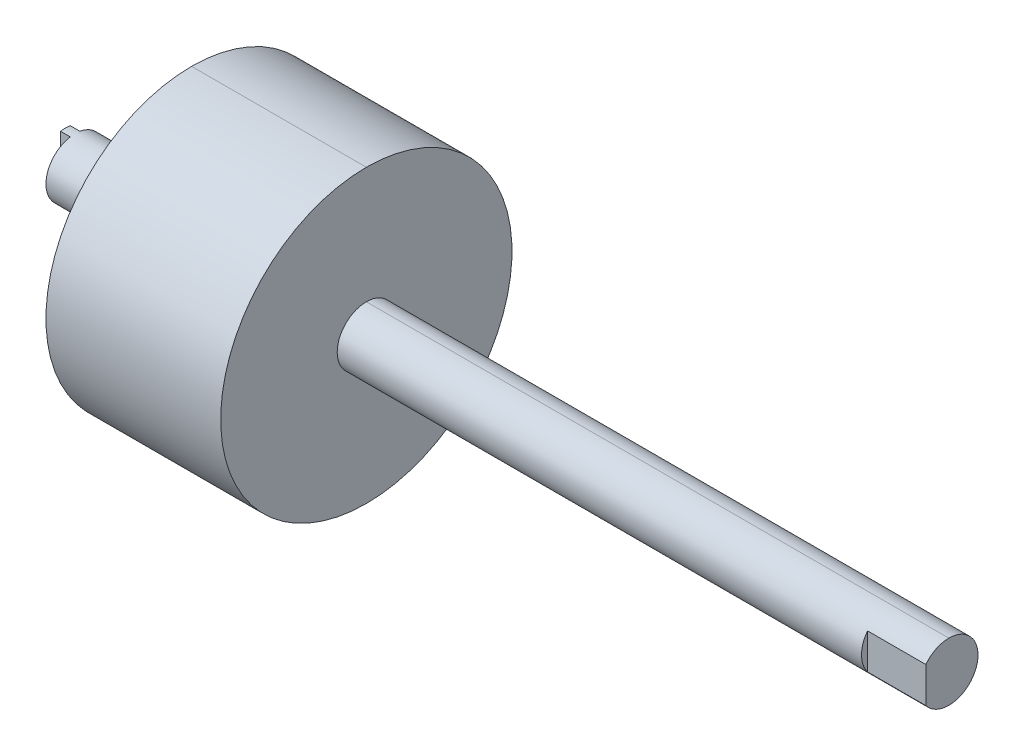
ISO-10303-21;
HEADER;
FILE_DESCRIPTION(('STEP AP214'),'2;1');
FILE_NAME('part.step','',(''),(''),'','','');
FILE_SCHEMA(('AUTOMOTIVE_DESIGN { 1 0 10303 214 1 1 1 1 }'));
ENDSEC;
DATA;
#1=APPLICATION_CONTEXT('core data for automotive mechanical design processes');
#2=APPLICATION_PROTOCOL_DEFINITION('international standard','automotive_design',2000,#1);
#3=PRODUCT_CONTEXT('',#1,'mechanical');
#4=PRODUCT('Part','Part','',(#3));
#5=PRODUCT_RELATED_PRODUCT_CATEGORY('part','',(#4));
#6=PRODUCT_DEFINITION_FORMATION('','',#4);
#7=PRODUCT_DEFINITION_CONTEXT('part definition',#1,'design');
#8=PRODUCT_DEFINITION('design','',#6,#7);
#9=PRODUCT_DEFINITION_SHAPE('','',#8);
#10=(LENGTH_UNIT() NAMED_UNIT(*) SI_UNIT(.MILLI.,.METRE.));
#11=(NAMED_UNIT(*) PLANE_ANGLE_UNIT() SI_UNIT($,.RADIAN.));
#12=(NAMED_UNIT(*) SI_UNIT($,.STERADIAN.) SOLID_ANGLE_UNIT());
#13=UNCERTAINTY_MEASURE_WITH_UNIT(LENGTH_MEASURE(1.E-05),#10,'distance_accuracy_value','');
#14=(GEOMETRIC_REPRESENTATION_CONTEXT(3) GLOBAL_UNCERTAINTY_ASSIGNED_CONTEXT((#13)) GLOBAL_UNIT_ASSIGNED_CONTEXT((#10,
#11,#12)) REPRESENTATION_CONTEXT('',''));
#15=CARTESIAN_POINT('',(0.,0.,0.));
#16=DIRECTION('',(0.,0.,1.));
#17=DIRECTION('',(1.,0.,0.));
#18=AXIS2_PLACEMENT_3D('',#15,#16,#17);
#19=CARTESIAN_POINT('',(-14.8266887400671,0.,-0.00491965653704956));
#20=DIRECTION('',(-1.,0.,0.));
#21=DIRECTION('',(0.,-1.,0.));
#22=AXIS2_PLACEMENT_3D('',#19,#20,#21);
#23=PLANE('',#22);
#24=CARTESIAN_POINT('',(-14.8266887400671,0.,-0.00491965653704956));
#25=DIRECTION('',(-1.,0.,0.));
#26=DIRECTION('',(0.,-1.,0.));
#27=AXIS2_PLACEMENT_3D('',#24,#25,#26);
#28=CIRCLE('',#27,3.84615384566538);
#29=CARTESIAN_POINT('',(-14.8266887400671,3.79253205715214,-0.64491965653705));
#30=VERTEX_POINT('',#29);
#31=CARTESIAN_POINT('',(-14.8266887400671,-3.79253205715214,-0.64491965653705));
#32=VERTEX_POINT('',#31);
#33=EDGE_CURVE('E66',#30,#32,#28,.T.);
#34=ORIENTED_EDGE('',*,*,#33,.T.);
#35=DIRECTION('',(0.,1.,0.));
#36=VECTOR('',#35,1.);
#37=CARTESIAN_POINT('',(-14.8266887400671,0.,-0.64491965653705));
#38=LINE('',#37,#36);
#39=EDGE_CURVE('E70',#32,#30,#38,.T.);
#40=ORIENTED_EDGE('',*,*,#39,.T.);
#41=EDGE_LOOP('',(#34,#40));
#42=FACE_BOUND('',#41,.T.);
#43=ADVANCED_FACE('F49',(#42),#23,.T.);
#44=CARTESIAN_POINT('',(-7.13438104873628,0.,-0.00491965653704956));
#45=DIRECTION('',(1.,0.,0.));
#46=DIRECTION('',(0.,-1.,0.));
#47=AXIS2_PLACEMENT_3D('',#44,#45,#46);
#48=CYLINDRICAL_SURFACE('',#47,3.84615384566538);
#49=CARTESIAN_POINT('',(-14.8266887400671,0.,-0.00491965653704956));
#50=DIRECTION('',(-1.,0.,0.));
#51=DIRECTION('',(0.,-1.,0.));
#52=AXIS2_PLACEMENT_3D('',#49,#50,#51);
#53=CIRCLE('',#52,3.84615384566538);
#54=CARTESIAN_POINT('',(-14.8266887400671,-3.79253205715214,0.63508034346295));
#55=VERTEX_POINT('',#54);
#56=CARTESIAN_POINT('',(-14.8266887400671,3.79253205715214,0.63508034346295));
#57=VERTEX_POINT('',#56);
#58=EDGE_CURVE('E204',#55,#57,#53,.T.);
#59=ORIENTED_EDGE('',*,*,#58,.F.);
#60=DIRECTION('',(1.,0.,0.));
#61=VECTOR('',#60,1.);
#62=CARTESIAN_POINT('',(-16.106688740067,-3.79253205715214,0.63508034346295));
#63=LINE('',#62,#61);
#64=CARTESIAN_POINT('',(-16.106688740067,-3.79253205715214,0.63508034346295));
#65=VERTEX_POINT('',#64);
#66=EDGE_CURVE('E160',#65,#55,#63,.T.);
#67=ORIENTED_EDGE('',*,*,#66,.F.);
#68=CARTESIAN_POINT('',(-16.106688740067,0.,-0.00491965653704956));
#69=DIRECTION('',(-1.,0.,0.));
#70=DIRECTION('',(0.,0.,1.));
#71=AXIS2_PLACEMENT_3D('',#68,#69,#70);
#72=CIRCLE('',#71,3.84615384566538);
#73=CARTESIAN_POINT('',(-16.106688740067,-3.79253205715214,-0.64491965653705));
#74=VERTEX_POINT('',#73);
#75=EDGE_CURVE('E163',#74,#65,#72,.T.);
#76=ORIENTED_EDGE('',*,*,#75,.F.);
#77=DIRECTION('',(1.,0.,0.));
#78=VECTOR('',#77,1.);
#79=CARTESIAN_POINT('',(-16.106688740067,-3.79253205715214,-0.64491965653705));
#80=LINE('',#79,#78);
#81=EDGE_CURVE('E152',#74,#32,#80,.T.);
#82=ORIENTED_EDGE('',*,*,#81,.T.);
#83=ORIENTED_EDGE('',*,*,#33,.F.);
#84=DIRECTION('',(1.,0.,0.));
#85=VECTOR('',#84,1.);
#86=CARTESIAN_POINT('',(-16.106688740067,3.79253205715214,-0.64491965653705));
#87=LINE('',#86,#85);
#88=CARTESIAN_POINT('',(-16.106688740067,3.79253205715214,-0.64491965653705));
#89=VERTEX_POINT('',#88);
#90=EDGE_CURVE('E182',#89,#30,#87,.T.);
#91=ORIENTED_EDGE('',*,*,#90,.F.);
#92=CARTESIAN_POINT('',(-16.106688740067,3.79253205715214,0.63508034346295));
#93=VERTEX_POINT('',#92);
#94=EDGE_CURVE('E171',#93,#89,#72,.T.);
#95=ORIENTED_EDGE('',*,*,#94,.F.);
#96=DIRECTION('',(1.,0.,0.));
#97=VECTOR('',#96,1.);
#98=CARTESIAN_POINT('',(-16.106688740067,3.79253205715214,0.63508034346295));
#99=LINE('',#98,#97);
#100=EDGE_CURVE('E184',#93,#57,#99,.T.);
#101=ORIENTED_EDGE('',*,*,#100,.T.);
#102=EDGE_LOOP('',(#59,#67,#76,#82,#83,#91,#95,#101));
#103=FACE_BOUND('',#102,.T.);
#104=DIRECTION('',(-1.,0.,0.));
#105=VECTOR('',#104,1.);
#106=CARTESIAN_POINT('',(-7.13438104873628,-3.84615384566538,-0.00491965653704956));
#107=LINE('',#106,#105);
#108=CARTESIAN_POINT('',(0.557926642594494,-3.84615384566538,-0.00491965653704956));
#109=VERTEX_POINT('',#108);
#110=CARTESIAN_POINT('',(-14.8266887400671,-3.84615384566538,-0.00491965653704956));
#111=VERTEX_POINT('',#110);
#112=EDGE_CURVE('E203',#109,#111,#107,.T.);
#113=ORIENTED_EDGE('',*,*,#112,.F.);
#114=CARTESIAN_POINT('',(0.557926642594494,0.,-0.00491965653704956));
#115=DIRECTION('',(-1.,0.,0.));
#116=DIRECTION('',(0.,-1.,0.));
#117=AXIS2_PLACEMENT_3D('',#114,#115,#116);
#118=CIRCLE('',#117,3.84615384566538);
#119=CARTESIAN_POINT('',(0.557926642594494,3.84615384566538,-0.00491965653704738));
#120=VERTEX_POINT('',#119);
#121=EDGE_CURVE('E11',#109,#120,#118,.T.);
#122=ORIENTED_EDGE('',*,*,#121,.T.);
#123=DIRECTION('',(-1.,0.,0.));
#124=VECTOR('',#123,1.);
#125=CARTESIAN_POINT('',(-7.13438104873628,3.84615384566538,-0.00491965653704909));
#126=LINE('',#125,#124);
#127=CARTESIAN_POINT('',(-14.8266887400671,3.84615384566538,-0.00491965653704909));
#128=VERTEX_POINT('',#127);
#129=EDGE_CURVE('E59',#120,#128,#126,.T.);
#130=ORIENTED_EDGE('',*,*,#129,.T.);
#131=ORIENTED_EDGE('',*,*,#129,.F.);
#132=CARTESIAN_POINT('',(0.557926642594494,0.,-0.00491965653704956));
#133=DIRECTION('',(-1.,0.,0.));
#134=DIRECTION('',(0.,-1.,0.));
#135=AXIS2_PLACEMENT_3D('',#132,#133,#134);
#136=CIRCLE('',#135,3.84615384566538);
#137=EDGE_CURVE('E199',#120,#109,#136,.T.);
#138=ORIENTED_EDGE('',*,*,#137,.T.);
#139=ORIENTED_EDGE('',*,*,#112,.T.);
#140=EDGE_LOOP('',(#113,#122,#130,#131,#138,#139));
#141=FACE_BOUND('',#140,.T.);
#142=ADVANCED_FACE('F51',(#103,#141),#48,.T.);
#143=DIRECTION('',(0.,1.,0.));
#144=VECTOR('',#143,1.);
#145=CARTESIAN_POINT('',(-14.8266887400671,0.,0.63508034346295));
#146=LINE('',#145,#144);
#147=EDGE_CURVE('E175',#55,#57,#146,.T.);
#148=ORIENTED_EDGE('',*,*,#147,.F.);
#149=ORIENTED_EDGE('',*,*,#58,.T.);
#150=EDGE_LOOP('',(#148,#149));
#151=FACE_BOUND('',#150,.T.);
#152=ADVANCED_FACE('F447',(#151),#23,.T.);
#153=CARTESIAN_POINT('',(0.557926642594494,0.,-0.00491965653704956));
#154=DIRECTION('',(1.,0.,0.));
#155=DIRECTION('',(0.,1.,0.));
#156=AXIS2_PLACEMENT_3D('',#153,#154,#155);
#157=PLANE('',#156);
#158=CARTESIAN_POINT('',(0.557926642594494,0.,-0.00491965653704956));
#159=DIRECTION('',(1.,0.,0.));
#160=DIRECTION('',(0.,1.,0.));
#161=AXIS2_PLACEMENT_3D('',#158,#159,#160);
#162=CIRCLE('',#161,19.2307692283269);
#163=CARTESIAN_POINT('',(0.557926642594494,-19.2307692283269,-0.00491965653704721));
#164=VERTEX_POINT('',#163);
#165=CARTESIAN_POINT('',(0.557926642594494,19.2307692283269,-0.00491965653704956));
#166=VERTEX_POINT('',#165);
#167=EDGE_CURVE('E215',#164,#166,#162,.T.);
#168=ORIENTED_EDGE('',*,*,#167,.F.);
#169=CARTESIAN_POINT('',(0.557926642594494,0.,-0.00491965653704956));
#170=DIRECTION('',(1.,0.,0.));
#171=DIRECTION('',(0.,1.,0.));
#172=AXIS2_PLACEMENT_3D('',#169,#170,#171);
#173=CIRCLE('',#172,19.2307692283269);
#174=EDGE_CURVE('E214',#166,#164,#173,.T.);
#175=ORIENTED_EDGE('',*,*,#174,.F.);
#176=EDGE_LOOP('',(#168,#175));
#177=FACE_BOUND('',#176,.T.);
#178=ORIENTED_EDGE('',*,*,#137,.F.);
#179=ORIENTED_EDGE('',*,*,#121,.F.);
#180=EDGE_LOOP('',(#178,#179));
#181=FACE_BOUND('',#180,.T.);
#182=ADVANCED_FACE('F337',(#177,#181),#157,.F.);
#183=CARTESIAN_POINT('',(12.0963881795906,0.,-0.00491965653704956));
#184=DIRECTION('',(-1.,0.,0.));
#185=DIRECTION('',(0.,1.,0.));
#186=AXIS2_PLACEMENT_3D('',#183,#184,#185);
#187=CYLINDRICAL_SURFACE('',#186,19.2307692283269);
#188=DIRECTION('',(1.,0.,0.));
#189=VECTOR('',#188,1.);
#190=CARTESIAN_POINT('',(12.0963881795906,19.2307692283269,-0.00491965653704956));
#191=LINE('',#190,#189);
#192=CARTESIAN_POINT('',(23.6348497165868,19.2307692283269,-0.00491965653704956));
#193=VERTEX_POINT('',#192);
#194=EDGE_CURVE('E219',#166,#193,#191,.T.);
#195=ORIENTED_EDGE('',*,*,#194,.F.);
#196=ORIENTED_EDGE('',*,*,#174,.T.);
#197=DIRECTION('',(1.,0.,0.));
#198=VECTOR('',#197,1.);
#199=CARTESIAN_POINT('',(12.0963881795906,-19.2307692283269,-0.00491965653703866));
#200=LINE('',#199,#198);
#201=CARTESIAN_POINT('',(23.6348497165868,-19.2307692283269,-0.00491965653704721));
#202=VERTEX_POINT('',#201);
#203=EDGE_CURVE('E210',#164,#202,#200,.T.);
#204=ORIENTED_EDGE('',*,*,#203,.T.);
#205=CARTESIAN_POINT('',(23.6348497165868,0.,-0.00491965653704956));
#206=DIRECTION('',(1.,0.,0.));
#207=DIRECTION('',(0.,1.,0.));
#208=AXIS2_PLACEMENT_3D('',#205,#206,#207);
#209=CIRCLE('',#208,19.2307692283269);
#210=EDGE_CURVE('E216',#193,#202,#209,.T.);
#211=ORIENTED_EDGE('',*,*,#210,.F.);
#212=EDGE_LOOP('',(#195,#196,#204,#211));
#213=FACE_BOUND('',#212,.T.);
#214=ADVANCED_FACE('F350',(#213),#187,.T.);
#215=CARTESIAN_POINT('',(12.0963881795906,0.,-0.00491965653704956));
#216=DIRECTION('',(-1.,0.,0.));
#217=DIRECTION('',(0.,1.,0.));
#218=AXIS2_PLACEMENT_3D('',#215,#216,#217);
#219=CYLINDRICAL_SURFACE('',#218,19.2307692283269);
#220=ORIENTED_EDGE('',*,*,#203,.F.);
#221=ORIENTED_EDGE('',*,*,#167,.T.);
#222=ORIENTED_EDGE('',*,*,#194,.T.);
#223=CARTESIAN_POINT('',(23.6348497165868,0.,-0.00491965653704956));
#224=DIRECTION('',(1.,0.,0.));
#225=DIRECTION('',(0.,1.,0.));
#226=AXIS2_PLACEMENT_3D('',#223,#224,#225);
#227=CIRCLE('',#226,19.2307692283269);
#228=EDGE_CURVE('E197',#202,#193,#227,.T.);
#229=ORIENTED_EDGE('',*,*,#228,.F.);
#230=EDGE_LOOP('',(#220,#221,#222,#229));
#231=FACE_BOUND('',#230,.T.);
#232=ADVANCED_FACE('F364',(#231),#219,.T.);
#233=CARTESIAN_POINT('',(23.6348497165868,0.,-0.00491965653704956));
#234=DIRECTION('',(1.,0.,0.));
#235=DIRECTION('',(0.,1.,0.));
#236=AXIS2_PLACEMENT_3D('',#233,#234,#235);
#237=PLANE('',#236);
#238=ORIENTED_EDGE('',*,*,#210,.T.);
#239=ORIENTED_EDGE('',*,*,#228,.T.);
#240=EDGE_LOOP('',(#238,#239));
#241=FACE_BOUND('',#240,.T.);
#242=CARTESIAN_POINT('',(23.6348497165868,0.,-0.00491965653704956));
#243=DIRECTION('',(1.,0.,0.));
#244=DIRECTION('',(0.,1.,0.));
#245=AXIS2_PLACEMENT_3D('',#242,#243,#244);
#246=CIRCLE('',#245,3.84615384566538);
#247=CARTESIAN_POINT('',(23.6348497165868,3.84615384566538,-0.00491965653704956));
#248=VERTEX_POINT('',#247);
#249=CARTESIAN_POINT('',(23.6348497165868,-3.84615384566538,-0.0049196565370508));
#250=VERTEX_POINT('',#249);
#251=EDGE_CURVE('E247',#248,#250,#246,.T.);
#252=ORIENTED_EDGE('',*,*,#251,.F.);
#253=CARTESIAN_POINT('',(23.6348497165868,0.,-0.00491965653704956));
#254=DIRECTION('',(1.,0.,0.));
#255=DIRECTION('',(0.,1.,0.));
#256=AXIS2_PLACEMENT_3D('',#253,#254,#255);
#257=CIRCLE('',#256,3.84615384566538);
#258=EDGE_CURVE('E193',#250,#248,#257,.T.);
#259=ORIENTED_EDGE('',*,*,#258,.F.);
#260=EDGE_LOOP('',(#252,#259));
#261=FACE_BOUND('',#260,.T.);
#262=ADVANCED_FACE('F370',(#241,#261),#237,.T.);
#263=CARTESIAN_POINT('',(62.0963881732407,0.,-0.00491965653704956));
#264=DIRECTION('',(-1.,0.,0.));
#265=DIRECTION('',(0.,1.,0.));
#266=AXIS2_PLACEMENT_3D('',#263,#264,#265);
#267=CYLINDRICAL_SURFACE('',#266,3.84615384566538);
#268=DIRECTION('',(1.,0.,0.));
#269=VECTOR('',#268,1.);
#270=CARTESIAN_POINT('',(62.0963881732407,-3.84615384566538,-0.0049196565370508));
#271=LINE('',#270,#269);
#272=CARTESIAN_POINT('',(100.557926629895,-3.84615384566538,-0.0049196565370508));
#273=VERTEX_POINT('',#272);
#274=EDGE_CURVE('E257',#250,#273,#271,.T.);
#275=ORIENTED_EDGE('',*,*,#274,.F.);
#276=ORIENTED_EDGE('',*,*,#258,.T.);
#277=DIRECTION('',(1.,0.,0.));
#278=VECTOR('',#277,1.);
#279=CARTESIAN_POINT('',(62.0963881732407,3.84615384566538,-0.00491965653704956));
#280=LINE('',#279,#278);
#281=CARTESIAN_POINT('',(100.557926629895,3.84615384566538,-0.00491965653704956));
#282=VERTEX_POINT('',#281);
#283=EDGE_CURVE('E198',#248,#282,#280,.T.);
#284=ORIENTED_EDGE('',*,*,#283,.T.);
#285=CARTESIAN_POINT('',(100.557926629895,0.,-0.00491965653704956));
#286=DIRECTION('',(1.,0.,0.));
#287=DIRECTION('',(0.,1.,0.));
#288=AXIS2_PLACEMENT_3D('',#285,#286,#287);
#289=CIRCLE('',#288,3.84615384566538);
#290=EDGE_CURVE('E224',#273,#282,#289,.T.);
#291=ORIENTED_EDGE('',*,*,#290,.F.);
#292=EDGE_LOOP('',(#275,#276,#284,#291));
#293=FACE_BOUND('',#292,.T.);
#294=ADVANCED_FACE('F272',(#293),#267,.T.);
#295=CARTESIAN_POINT('',(62.0963881732407,0.,-0.00491965653704956));
#296=DIRECTION('',(-1.,0.,0.));
#297=DIRECTION('',(0.,1.,0.));
#298=AXIS2_PLACEMENT_3D('',#295,#296,#297);
#299=CYLINDRICAL_SURFACE('',#298,3.84615384566538);
#300=CARTESIAN_POINT('',(100.557926629895,0.,-0.00491965653704956));
#301=DIRECTION('',(1.,0.,0.));
#302=DIRECTION('',(0.,1.,0.));
#303=AXIS2_PLACEMENT_3D('',#300,#301,#302);
#304=CIRCLE('',#303,3.84615384566538);
#305=CARTESIAN_POINT('',(100.557926629895,2.34849288926872,3.04097603333496));
#306=VERTEX_POINT('',#305);
#307=EDGE_CURVE('E220',#282,#306,#304,.T.);
#308=ORIENTED_EDGE('',*,*,#307,.F.);
#309=ORIENTED_EDGE('',*,*,#283,.F.);
#310=ORIENTED_EDGE('',*,*,#251,.T.);
#311=ORIENTED_EDGE('',*,*,#274,.T.);
#312=CARTESIAN_POINT('',(100.557926629895,0.,-0.00491965653704956));
#313=DIRECTION('',(1.,0.,0.));
#314=DIRECTION('',(0.,1.,0.));
#315=AXIS2_PLACEMENT_3D('',#312,#313,#314);
#316=CIRCLE('',#315,3.84615384566538);
#317=CARTESIAN_POINT('',(100.557926629895,-2.34849288926873,3.04097603333496));
#318=VERTEX_POINT('',#317);
#319=EDGE_CURVE('E248',#318,#273,#316,.T.);
#320=ORIENTED_EDGE('',*,*,#319,.F.);
#321=DIRECTION('',(-1.,0.,0.));
#322=VECTOR('',#321,1.);
#323=CARTESIAN_POINT('',(96.7117727842291,-2.34849288926873,3.04097603333496));
#324=LINE('',#323,#322);
#325=CARTESIAN_POINT('',(92.8656189385638,-2.34849288926873,3.04097603333496));
#326=VERTEX_POINT('',#325);
#327=EDGE_CURVE('E53',#318,#326,#324,.T.);
#328=ORIENTED_EDGE('',*,*,#327,.T.);
#329=CARTESIAN_POINT('',(92.8656189385638,0.,-0.00491965653704956));
#330=DIRECTION('',(1.,0.,0.));
#331=DIRECTION('',(0.,1.,0.));
#332=AXIS2_PLACEMENT_3D('',#329,#330,#331);
#333=CIRCLE('',#332,3.84615384566538);
#334=CARTESIAN_POINT('',(92.8656189385638,2.34849288926872,3.04097603333496));
#335=VERTEX_POINT('',#334);
#336=EDGE_CURVE('E192',#335,#326,#333,.T.);
#337=ORIENTED_EDGE('',*,*,#336,.F.);
#338=DIRECTION('',(-1.,0.,0.));
#339=VECTOR('',#338,1.);
#340=CARTESIAN_POINT('',(96.7117727842291,2.34849288926872,3.04097603333496));
#341=LINE('',#340,#339);
#342=EDGE_CURVE('E159',#306,#335,#341,.T.);
#343=ORIENTED_EDGE('',*,*,#342,.F.);
#344=EDGE_LOOP('',(#308,#309,#310,#311,#320,#328,#337,#343));
#345=FACE_BOUND('',#344,.T.);
#346=ADVANCED_FACE('F276',(#345),#299,.T.);
#347=CARTESIAN_POINT('',(100.557926629895,0.,-0.00491965653704956));
#348=DIRECTION('',(1.,0.,0.));
#349=DIRECTION('',(0.,1.,0.));
#350=AXIS2_PLACEMENT_3D('',#347,#348,#349);
#351=PLANE('',#350);
#352=ORIENTED_EDGE('',*,*,#319,.T.);
#353=ORIENTED_EDGE('',*,*,#290,.T.);
#354=ORIENTED_EDGE('',*,*,#307,.T.);
#355=DIRECTION('',(0.,1.,0.));
#356=VECTOR('',#355,1.);
#357=CARTESIAN_POINT('',(100.557926629895,0.,3.04097603333496));
#358=LINE('',#357,#356);
#359=EDGE_CURVE('E188',#318,#306,#358,.T.);
#360=ORIENTED_EDGE('',*,*,#359,.F.);
#361=EDGE_LOOP('',(#352,#353,#354,#360));
#362=FACE_BOUND('',#361,.T.);
#363=ADVANCED_FACE('F265',(#362),#351,.T.);
#364=CARTESIAN_POINT('',(92.8656189385638,0.,-0.00491965653704956));
#365=DIRECTION('',(1.,0.,0.));
#366=DIRECTION('',(0.,1.,0.));
#367=AXIS2_PLACEMENT_3D('',#364,#365,#366);
#368=PLANE('',#367);
#369=DIRECTION('',(0.,1.,0.));
#370=VECTOR('',#369,1.);
#371=CARTESIAN_POINT('',(92.8656189385638,0.,3.04097603333496));
#372=LINE('',#371,#370);
#373=EDGE_CURVE('E209',#326,#335,#372,.T.);
#374=ORIENTED_EDGE('',*,*,#373,.T.);
#375=ORIENTED_EDGE('',*,*,#336,.T.);
#376=EDGE_LOOP('',(#374,#375));
#377=FACE_BOUND('',#376,.T.);
#378=ADVANCED_FACE('F344',(#377),#368,.T.);
#379=CARTESIAN_POINT('',(100.557926629895,4.43206159740408,3.04097603333496));
#380=DIRECTION('',(0.,0.,-1.));
#381=DIRECTION('',(0.,-1.,0.));
#382=AXIS2_PLACEMENT_3D('',#379,#380,#381);
#383=PLANE('',#382);
#384=ORIENTED_EDGE('',*,*,#373,.F.);
#385=ORIENTED_EDGE('',*,*,#327,.F.);
#386=ORIENTED_EDGE('',*,*,#359,.T.);
#387=ORIENTED_EDGE('',*,*,#342,.T.);
#388=EDGE_LOOP('',(#384,#385,#386,#387));
#389=FACE_BOUND('',#388,.T.);
#390=ADVANCED_FACE('F282',(#389),#383,.F.);
#391=CARTESIAN_POINT('',(-16.106688740067,0.,-0.64491965653705));
#392=DIRECTION('',(0.,0.,-1.));
#393=DIRECTION('',(-1.,0.,0.));
#394=AXIS2_PLACEMENT_3D('',#391,#392,#393);
#395=PLANE('',#394);
#396=ORIENTED_EDGE('',*,*,#39,.F.);
#397=ORIENTED_EDGE('',*,*,#81,.F.);
#398=DIRECTION('',(0.,1.,0.));
#399=VECTOR('',#398,1.);
#400=CARTESIAN_POINT('',(-16.106688740067,0.,-0.64491965653705));
#401=LINE('',#400,#399);
#402=EDGE_CURVE('E157',#74,#89,#401,.T.);
#403=ORIENTED_EDGE('',*,*,#402,.T.);
#404=ORIENTED_EDGE('',*,*,#90,.T.);
#405=EDGE_LOOP('',(#396,#397,#403,#404));
#406=FACE_BOUND('',#405,.T.);
#407=ADVANCED_FACE('F154',(#406),#395,.T.);
#408=CARTESIAN_POINT('',(-16.106688740067,0.,0.63508034346295));
#409=DIRECTION('',(0.,0.,-1.));
#410=DIRECTION('',(-1.,0.,0.));
#411=AXIS2_PLACEMENT_3D('',#408,#409,#410);
#412=PLANE('',#411);
#413=ORIENTED_EDGE('',*,*,#147,.T.);
#414=ORIENTED_EDGE('',*,*,#100,.F.);
#415=DIRECTION('',(0.,1.,0.));
#416=VECTOR('',#415,1.);
#417=CARTESIAN_POINT('',(-16.106688740067,0.,0.63508034346295));
#418=LINE('',#417,#416);
#419=EDGE_CURVE('E169',#65,#93,#418,.T.);
#420=ORIENTED_EDGE('',*,*,#419,.F.);
#421=ORIENTED_EDGE('',*,*,#66,.T.);
#422=EDGE_LOOP('',(#413,#414,#420,#421));
#423=FACE_BOUND('',#422,.T.);
#424=ADVANCED_FACE('F495',(#423),#412,.F.);
#425=CARTESIAN_POINT('',(-16.106688740067,0.,0.));
#426=DIRECTION('',(-1.,0.,0.));
#427=DIRECTION('',(0.,0.,1.));
#428=AXIS2_PLACEMENT_3D('',#425,#426,#427);
#429=PLANE('',#428);
#430=ORIENTED_EDGE('',*,*,#402,.F.);
#431=ORIENTED_EDGE('',*,*,#75,.T.);
#432=ORIENTED_EDGE('',*,*,#419,.T.);
#433=ORIENTED_EDGE('',*,*,#94,.T.);
#434=EDGE_LOOP('',(#430,#431,#432,#433));
#435=FACE_BOUND('',#434,.T.);
#436=ADVANCED_FACE('F172',(#435),#429,.T.);
#437=CLOSED_SHELL('',(#43,#142,#152,#182,#214,#232,#262,#294,#346,#363,#378,#390,#407,#424,#436));
#438=MANIFOLD_SOLID_BREP('B2',#437);
#439=ADVANCED_BREP_SHAPE_REPRESENTATION('',(#18,#438),#14);
#440=SHAPE_DEFINITION_REPRESENTATION(#9,#439);
ENDSEC;
END-ISO-10303-21;
